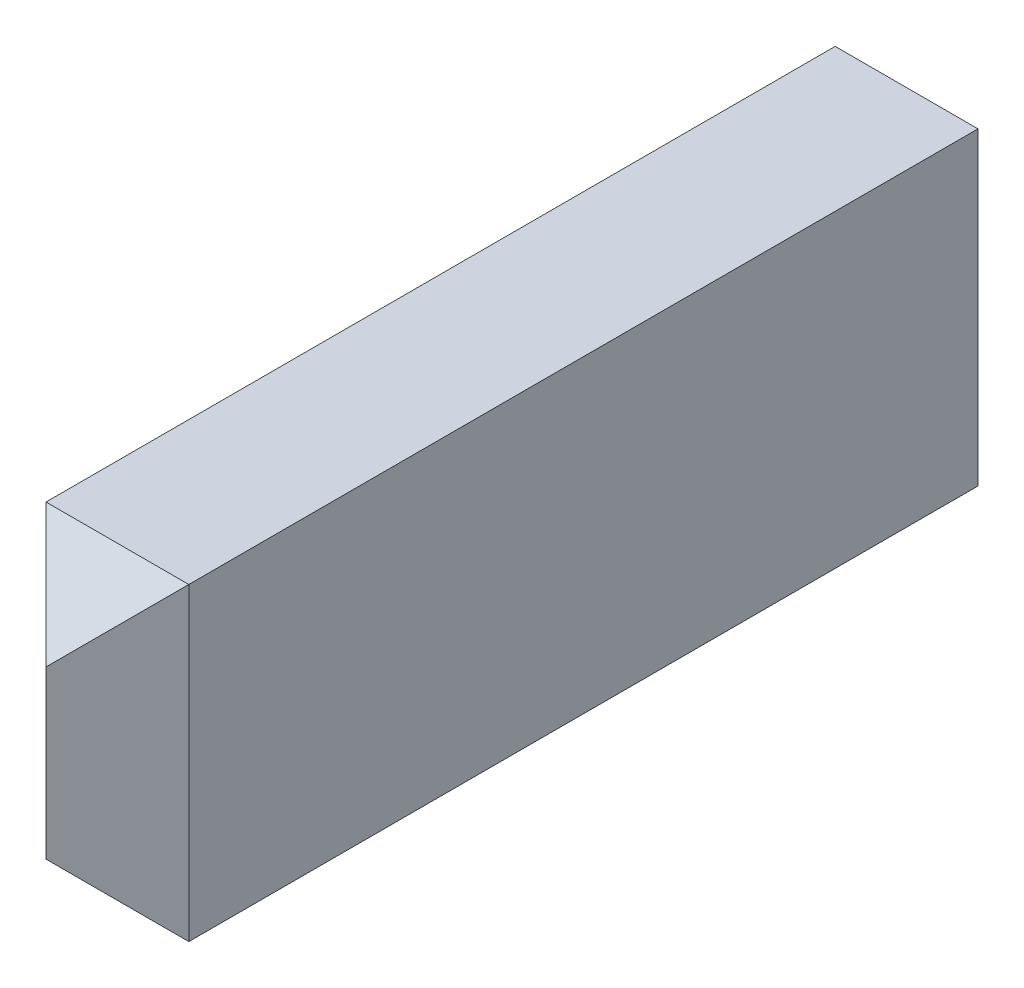
ISO-10303-21;
HEADER;
FILE_DESCRIPTION(('STEP AP214'),'2;1');
FILE_NAME('part.step','',(''),(''),'','','');
FILE_SCHEMA(('AUTOMOTIVE_DESIGN { 1 0 10303 214 1 1 1 1 }'));
ENDSEC;
DATA;
#1=APPLICATION_CONTEXT('core data for automotive mechanical design processes');
#2=APPLICATION_PROTOCOL_DEFINITION('international standard','automotive_design',2000,#1);
#3=PRODUCT_CONTEXT('',#1,'mechanical');
#4=PRODUCT('Part','Part','',(#3));
#5=PRODUCT_RELATED_PRODUCT_CATEGORY('part','',(#4));
#6=PRODUCT_DEFINITION_FORMATION('','',#4);
#7=PRODUCT_DEFINITION_CONTEXT('part definition',#1,'design');
#8=PRODUCT_DEFINITION('design','',#6,#7);
#9=PRODUCT_DEFINITION_SHAPE('','',#8);
#10=(LENGTH_UNIT() NAMED_UNIT(*) SI_UNIT(.MILLI.,.METRE.));
#11=(NAMED_UNIT(*) PLANE_ANGLE_UNIT() SI_UNIT($,.RADIAN.));
#12=(NAMED_UNIT(*) SI_UNIT($,.STERADIAN.) SOLID_ANGLE_UNIT());
#13=UNCERTAINTY_MEASURE_WITH_UNIT(LENGTH_MEASURE(1.E-05),#10,'distance_accuracy_value','');
#14=(GEOMETRIC_REPRESENTATION_CONTEXT(3) GLOBAL_UNCERTAINTY_ASSIGNED_CONTEXT((#13)) GLOBAL_UNIT_ASSIGNED_CONTEXT((#10,
#11,#12)) REPRESENTATION_CONTEXT('',''));
#15=CARTESIAN_POINT('',(0.,0.,0.));
#16=DIRECTION('',(0.,0.,1.));
#17=DIRECTION('',(1.,0.,0.));
#18=AXIS2_PLACEMENT_3D('',#15,#16,#17);
#19=CARTESIAN_POINT('',(8.639175,-10.6553,-2.276475));
#20=DIRECTION('',(0.707106781186548,0.,0.707106781186548));
#21=DIRECTION('',(0.707106781186548,0.,-0.707106781186548));
#22=AXIS2_PLACEMENT_3D('',#19,#20,#21);
#23=PLANE('',#22);
#24=DIRECTION('',(-0.577350269189625,0.577350269189626,0.577350269189626));
#25=VECTOR('',#24,1.);
#26=CARTESIAN_POINT('',(9.13765,-13.8938,-2.77495));
#27=LINE('',#26,#25);
#28=CARTESIAN_POINT('',(9.13765,-13.8938,-2.77495));
#29=VERTEX_POINT('',#28);
#30=CARTESIAN_POINT('',(8.1407,-12.89685,-1.778));
#31=VERTEX_POINT('',#30);
#32=EDGE_CURVE('E69',#29,#31,#27,.T.);
#33=ORIENTED_EDGE('',*,*,#32,.F.);
#34=DIRECTION('',(0.,1.,0.));
#35=VECTOR('',#34,1.);
#36=CARTESIAN_POINT('',(9.13765,-9.5758,-2.77495));
#37=LINE('',#36,#35);
#38=CARTESIAN_POINT('',(9.13765,-9.5758,-2.77495));
#39=VERTEX_POINT('',#38);
#40=EDGE_CURVE('E66',#39,#29,#37,.F.);
#41=ORIENTED_EDGE('',*,*,#40,.F.);
#42=DIRECTION('',(0.577350269189626,0.577350269189627,-0.577350269189625));
#43=VECTOR('',#42,1.);
#44=CARTESIAN_POINT('',(8.1407,-10.57275,-1.778));
#45=LINE('',#44,#43);
#46=CARTESIAN_POINT('',(8.1407,-10.57275,-1.778));
#47=VERTEX_POINT('',#46);
#48=EDGE_CURVE('E20',#47,#39,#45,.T.);
#49=ORIENTED_EDGE('',*,*,#48,.F.);
#50=DIRECTION('',(0.,1.,0.));
#51=VECTOR('',#50,1.);
#52=CARTESIAN_POINT('',(8.1407,-12.8143,-1.778));
#53=LINE('',#52,#51);
#54=EDGE_CURVE('E61',#31,#47,#53,.T.);
#55=ORIENTED_EDGE('',*,*,#54,.F.);
#56=EDGE_LOOP('',(#33,#41,#49,#55));
#57=FACE_BOUND('',#56,.T.);
#58=ADVANCED_FACE('F17',(#57),#23,.T.);
#59=CARTESIAN_POINT('',(7.642225,-10.074275,-2.276475));
#60=DIRECTION('',(0.,0.707106781186546,0.707106781186549));
#61=DIRECTION('',(0.,-0.707106781186549,0.707106781186546));
#62=AXIS2_PLACEMENT_3D('',#59,#60,#61);
#63=PLANE('',#62);
#64=DIRECTION('',(1.,0.,0.));
#65=VECTOR('',#64,1.);
#66=CARTESIAN_POINT('',(7.14375,-9.5758,-2.77495));
#67=LINE('',#66,#65);
#68=CARTESIAN_POINT('',(7.14375,-9.5758,-2.77495));
#69=VERTEX_POINT('',#68);
#70=EDGE_CURVE('E74',#69,#39,#67,.T.);
#71=ORIENTED_EDGE('',*,*,#70,.F.);
#72=DIRECTION('',(-0.577350269189626,0.577350269189626,-0.577350269189626));
#73=VECTOR('',#72,1.);
#74=CARTESIAN_POINT('',(8.1407,-10.57275,-1.778));
#75=LINE('',#74,#73);
#76=EDGE_CURVE('E71',#47,#69,#75,.T.);
#77=ORIENTED_EDGE('',*,*,#76,.F.);
#78=ORIENTED_EDGE('',*,*,#48,.T.);
#79=EDGE_LOOP('',(#71,#77,#78));
#80=FACE_BOUND('',#79,.T.);
#81=ADVANCED_FACE('F72',(#80),#63,.T.);
#82=CARTESIAN_POINT('',(8.639175,-13.395325,-2.276475));
#83=DIRECTION('',(0.,-0.707106781186547,0.707106781186548));
#84=DIRECTION('',(0.,-0.707106781186548,-0.707106781186547));
#85=AXIS2_PLACEMENT_3D('',#82,#83,#84);
#86=PLANE('',#85);
#87=DIRECTION('',(1.,0.,0.));
#88=VECTOR('',#87,1.);
#89=CARTESIAN_POINT('',(9.13765,-13.8938,-2.77495));
#90=LINE('',#89,#88);
#91=CARTESIAN_POINT('',(7.14375,-13.8938,-2.77495));
#92=VERTEX_POINT('',#91);
#93=EDGE_CURVE('E89',#29,#92,#90,.F.);
#94=ORIENTED_EDGE('',*,*,#93,.F.);
#95=ORIENTED_EDGE('',*,*,#32,.T.);
#96=DIRECTION('',(0.577350269189626,0.577350269189625,0.577350269189626));
#97=VECTOR('',#96,1.);
#98=CARTESIAN_POINT('',(7.14375,-13.8938,-2.77495));
#99=LINE('',#98,#97);
#100=EDGE_CURVE('E78',#92,#31,#99,.T.);
#101=ORIENTED_EDGE('',*,*,#100,.F.);
#102=EDGE_LOOP('',(#94,#95,#101));
#103=FACE_BOUND('',#102,.T.);
#104=ADVANCED_FACE('F87',(#103),#86,.T.);
#105=CARTESIAN_POINT('',(9.13765,-9.5758,-13.7922));
#106=DIRECTION('',(1.,0.,0.));
#107=DIRECTION('',(0.,0.,-1.));
#108=AXIS2_PLACEMENT_3D('',#105,#106,#107);
#109=PLANE('',#108);
#110=DIRECTION('',(0.,1.,0.));
#111=VECTOR('',#110,1.);
#112=CARTESIAN_POINT('',(9.13765,0.43180000000044,-13.7922000000013));
#113=LINE('',#112,#111);
#114=CARTESIAN_POINT('',(9.13765,-13.8938,-13.7922000000006));
#115=VERTEX_POINT('',#114);
#116=CARTESIAN_POINT('',(9.13765,-9.5758,-13.7922000000003));
#117=VERTEX_POINT('',#116);
#118=EDGE_CURVE('E110',#115,#117,#113,.T.);
#119=ORIENTED_EDGE('',*,*,#118,.T.);
#120=DIRECTION('',(0.,0.,1.));
#121=VECTOR('',#120,1.);
#122=CARTESIAN_POINT('',(9.13765,-9.5758,-13.7922));
#123=LINE('',#122,#121);
#124=EDGE_CURVE('E99',#39,#117,#123,.F.);
#125=ORIENTED_EDGE('',*,*,#124,.F.);
#126=ORIENTED_EDGE('',*,*,#40,.T.);
#127=DIRECTION('',(0.,0.,-1.));
#128=VECTOR('',#127,1.);
#129=CARTESIAN_POINT('',(9.13765,-13.8938,-13.7922));
#130=LINE('',#129,#128);
#131=EDGE_CURVE('E97',#115,#29,#130,.F.);
#132=ORIENTED_EDGE('',*,*,#131,.F.);
#133=EDGE_LOOP('',(#119,#125,#126,#132));
#134=FACE_BOUND('',#133,.T.);
#135=ADVANCED_FACE('F96',(#134),#109,.T.);
#136=CARTESIAN_POINT('',(7.642225,-12.8143,-2.276475));
#137=DIRECTION('',(-0.707106781186548,0.,0.707106781186547));
#138=DIRECTION('',(0.707106781186547,0.,0.707106781186548));
#139=AXIS2_PLACEMENT_3D('',#136,#137,#138);
#140=PLANE('',#139);
#141=DIRECTION('',(0.,1.,0.));
#142=VECTOR('',#141,1.);
#143=CARTESIAN_POINT('',(7.14375,-13.8938,-2.77495));
#144=LINE('',#143,#142);
#145=EDGE_CURVE('E101',#92,#69,#144,.T.);
#146=ORIENTED_EDGE('',*,*,#145,.F.);
#147=ORIENTED_EDGE('',*,*,#100,.T.);
#148=ORIENTED_EDGE('',*,*,#54,.T.);
#149=ORIENTED_EDGE('',*,*,#76,.T.);
#150=EDGE_LOOP('',(#146,#147,#148,#149));
#151=FACE_BOUND('',#150,.T.);
#152=ADVANCED_FACE('F81',(#151),#140,.T.);
#153=CARTESIAN_POINT('',(7.14375,-9.5758,-13.7922));
#154=DIRECTION('',(0.,1.,0.));
#155=DIRECTION('',(0.,0.,1.));
#156=AXIS2_PLACEMENT_3D('',#153,#154,#155);
#157=PLANE('',#156);
#158=DIRECTION('',(1.,0.,0.));
#159=VECTOR('',#158,1.);
#160=CARTESIAN_POINT('',(-1.77635683940025E-13,-9.5758,-13.7922000000013));
#161=LINE('',#160,#159);
#162=CARTESIAN_POINT('',(7.14375,-9.5758,-13.7922000000003));
#163=VERTEX_POINT('',#162);
#164=EDGE_CURVE('E92',#117,#163,#161,.F.);
#165=ORIENTED_EDGE('',*,*,#164,.T.);
#166=DIRECTION('',(0.,0.,1.));
#167=VECTOR('',#166,1.);
#168=CARTESIAN_POINT('',(7.14375,-9.5758,-13.7922));
#169=LINE('',#168,#167);
#170=EDGE_CURVE('E104',#69,#163,#169,.F.);
#171=ORIENTED_EDGE('',*,*,#170,.F.);
#172=ORIENTED_EDGE('',*,*,#70,.T.);
#173=ORIENTED_EDGE('',*,*,#124,.T.);
#174=EDGE_LOOP('',(#165,#171,#172,#173));
#175=FACE_BOUND('',#174,.T.);
#176=ADVANCED_FACE('F114',(#175),#157,.T.);
#177=CARTESIAN_POINT('',(-1.77635683940025E-13,0.43180000000044,-13.7922000000013));
#178=DIRECTION('',(0.,0.,1.));
#179=DIRECTION('',(1.,0.,0.));
#180=AXIS2_PLACEMENT_3D('',#177,#178,#179);
#181=PLANE('',#180);
#182=ORIENTED_EDGE('',*,*,#164,.F.);
#183=ORIENTED_EDGE('',*,*,#118,.F.);
#184=DIRECTION('',(1.,0.,0.));
#185=VECTOR('',#184,1.);
#186=CARTESIAN_POINT('',(9.13765,-13.8938,-13.7922));
#187=LINE('',#186,#185);
#188=CARTESIAN_POINT('',(7.14375,-13.8938,-13.7922000000006));
#189=VERTEX_POINT('',#188);
#190=EDGE_CURVE('E35',#189,#115,#187,.T.);
#191=ORIENTED_EDGE('',*,*,#190,.F.);
#192=DIRECTION('',(0.,1.,0.));
#193=VECTOR('',#192,1.);
#194=CARTESIAN_POINT('',(7.14375,-13.8938,-13.7922));
#195=LINE('',#194,#193);
#196=EDGE_CURVE('E26',#163,#189,#195,.F.);
#197=ORIENTED_EDGE('',*,*,#196,.F.);
#198=EDGE_LOOP('',(#182,#183,#191,#197));
#199=FACE_BOUND('',#198,.T.);
#200=ADVANCED_FACE('F121',(#199),#181,.F.);
#201=CARTESIAN_POINT('',(9.13765,-13.8938,-13.7922));
#202=DIRECTION('',(0.,-1.,0.));
#203=DIRECTION('',(0.,0.,-1.));
#204=AXIS2_PLACEMENT_3D('',#201,#202,#203);
#205=PLANE('',#204);
#206=ORIENTED_EDGE('',*,*,#190,.T.);
#207=ORIENTED_EDGE('',*,*,#131,.T.);
#208=ORIENTED_EDGE('',*,*,#93,.T.);
#209=DIRECTION('',(0.,0.,1.));
#210=VECTOR('',#209,1.);
#211=CARTESIAN_POINT('',(7.14375,-13.8938,-13.7922));
#212=LINE('',#211,#210);
#213=EDGE_CURVE('E11',#189,#92,#212,.T.);
#214=ORIENTED_EDGE('',*,*,#213,.F.);
#215=EDGE_LOOP('',(#206,#207,#208,#214));
#216=FACE_BOUND('',#215,.T.);
#217=ADVANCED_FACE('F100',(#216),#205,.T.);
#218=CARTESIAN_POINT('',(7.14375,-13.8938,-13.7922));
#219=DIRECTION('',(-1.,0.,0.));
#220=DIRECTION('',(0.,0.,1.));
#221=AXIS2_PLACEMENT_3D('',#218,#219,#220);
#222=PLANE('',#221);
#223=ORIENTED_EDGE('',*,*,#196,.T.);
#224=ORIENTED_EDGE('',*,*,#213,.T.);
#225=ORIENTED_EDGE('',*,*,#145,.T.);
#226=ORIENTED_EDGE('',*,*,#170,.T.);
#227=EDGE_LOOP('',(#223,#224,#225,#226));
#228=FACE_BOUND('',#227,.T.);
#229=ADVANCED_FACE('F119',(#228),#222,.T.);
#230=CLOSED_SHELL('',(#58,#81,#104,#135,#152,#176,#200,#217,#229));
#231=MANIFOLD_SOLID_BREP('B1',#230);
#232=ADVANCED_BREP_SHAPE_REPRESENTATION('',(#18,#231),#14);
#233=SHAPE_DEFINITION_REPRESENTATION(#9,#232);
ENDSEC;
END-ISO-10303-21;
